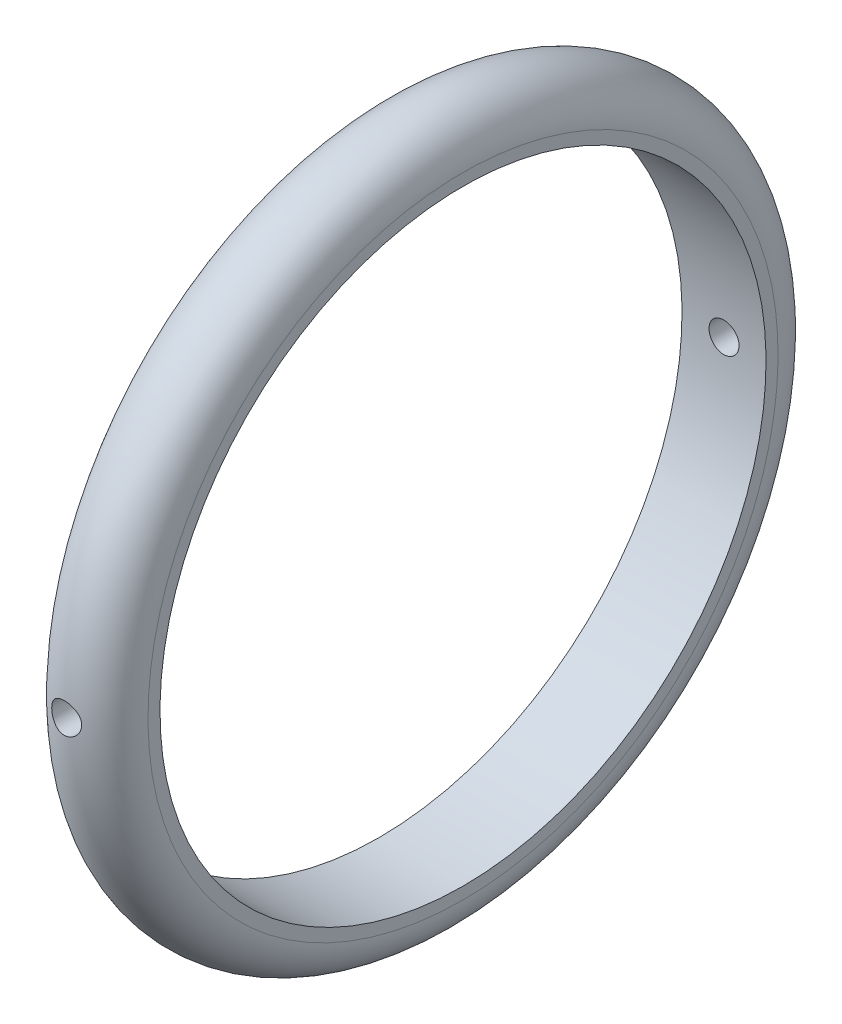
ISO-10303-21;
HEADER;
FILE_DESCRIPTION(('STEP AP214'),'2;1');
FILE_NAME('part.step','',(''),(''),'','','');
FILE_SCHEMA(('AUTOMOTIVE_DESIGN { 1 0 10303 214 1 1 1 1 }'));
ENDSEC;
DATA;
#1=APPLICATION_CONTEXT('core data for automotive mechanical design processes');
#2=APPLICATION_PROTOCOL_DEFINITION('international standard','automotive_design',2000,#1);
#3=PRODUCT_CONTEXT('',#1,'mechanical');
#4=PRODUCT('Part','Part','',(#3));
#5=PRODUCT_RELATED_PRODUCT_CATEGORY('part','',(#4));
#6=PRODUCT_DEFINITION_FORMATION('','',#4);
#7=PRODUCT_DEFINITION_CONTEXT('part definition',#1,'design');
#8=PRODUCT_DEFINITION('design','',#6,#7);
#9=PRODUCT_DEFINITION_SHAPE('','',#8);
#10=(LENGTH_UNIT() NAMED_UNIT(*) SI_UNIT(.MILLI.,.METRE.));
#11=(NAMED_UNIT(*) PLANE_ANGLE_UNIT() SI_UNIT($,.RADIAN.));
#12=(NAMED_UNIT(*) SI_UNIT($,.STERADIAN.) SOLID_ANGLE_UNIT());
#13=UNCERTAINTY_MEASURE_WITH_UNIT(LENGTH_MEASURE(1.E-05),#10,'distance_accuracy_value','');
#14=(GEOMETRIC_REPRESENTATION_CONTEXT(3) GLOBAL_UNCERTAINTY_ASSIGNED_CONTEXT((#13)) GLOBAL_UNIT_ASSIGNED_CONTEXT((#10,
#11,#12)) REPRESENTATION_CONTEXT('',''));
#15=CARTESIAN_POINT('',(0.,0.,0.));
#16=DIRECTION('',(0.,0.,1.));
#17=DIRECTION('',(1.,0.,0.));
#18=AXIS2_PLACEMENT_3D('',#15,#16,#17);
#19=CARTESIAN_POINT('',(14.,0.,0.));
#20=DIRECTION('',(1.,0.,0.));
#21=DIRECTION('',(0.,1.,0.));
#22=AXIS2_PLACEMENT_3D('',#19,#20,#21);
#23=PLANE('',#22);
#24=CARTESIAN_POINT('',(14.,0.,0.));
#25=DIRECTION('',(-1.,0.,0.));
#26=DIRECTION('',(0.,-1.,0.));
#27=AXIS2_PLACEMENT_3D('',#24,#25,#26);
#28=CIRCLE('',#27,50.5);
#29=CARTESIAN_POINT('',(14.,-50.5,0.));
#30=VERTEX_POINT('',#29);
#31=EDGE_CURVE('E95',#30,#30,#28,.T.);
#32=ORIENTED_EDGE('',*,*,#31,.T.);
#33=EDGE_LOOP('',(#32));
#34=FACE_BOUND('',#33,.T.);
#35=CARTESIAN_POINT('',(14.,0.,0.));
#36=DIRECTION('',(-1.,0.,0.));
#37=DIRECTION('',(0.,-1.,0.));
#38=AXIS2_PLACEMENT_3D('',#35,#36,#37);
#39=CIRCLE('',#38,52.5);
#40=CARTESIAN_POINT('',(14.,-52.5,0.));
#41=VERTEX_POINT('',#40);
#42=EDGE_CURVE('E10',#41,#41,#39,.T.);
#43=ORIENTED_EDGE('',*,*,#42,.F.);
#44=EDGE_LOOP('',(#43));
#45=FACE_BOUND('',#44,.T.);
#46=ADVANCED_FACE('F39',(#34,#45),#23,.T.);
#47=CARTESIAN_POINT('',(7.00000000000001,0.,0.));
#48=DIRECTION('',(-1.,0.,0.));
#49=DIRECTION('',(0.,-1.,0.));
#50=AXIS2_PLACEMENT_3D('',#47,#48,#49);
#51=TOROIDAL_SURFACE('',#50,52.5,7.);
#52=CARTESIAN_POINT('',(4.87163120326486,-1.31150534310364,-59.1540496103953));
#53=CARTESIAN_POINT('',(4.94611137543763,-1.43237184078808,-59.1751458680516));
#54=CARTESIAN_POINT('',(5.03078648713814,-1.54669430781488,-59.1979027770777));
#55=CARTESIAN_POINT('',(5.21819064564285,-1.75933464895137,-59.2441027546002));
#56=CARTESIAN_POINT('',(5.32092818611759,-1.85764495142243,-59.267546141564));
#57=CARTESIAN_POINT('',(5.54187610571056,-2.03568307051681,-59.3125295863226));
#58=CARTESIAN_POINT('',(5.6600933236139,-2.11540263036833,-59.3340687957815));
#59=CARTESIAN_POINT('',(5.90888206113082,-2.25382148004429,-59.372867145896));
#60=CARTESIAN_POINT('',(6.03944987661339,-2.31252704717126,-59.390127564238));
#61=CARTESIAN_POINT('',(6.30700379302199,-2.4061370232687,-59.4182113984056));
#62=CARTESIAN_POINT('',(6.44384235042178,-2.44143048763227,-59.4291396310481));
#63=CARTESIAN_POINT('',(6.72187707691259,-2.48847579267167,-59.4437974782728));
#64=CARTESIAN_POINT('',(6.86307213105977,-2.5002336068288,-59.4475289194326));
#65=CARTESIAN_POINT('',(7.13959141848879,-2.4997689756568,-59.4473834540307));
#66=CARTESIAN_POINT('',(7.27491852001956,-2.4885119139348,-59.4438128383451));
#67=CARTESIAN_POINT('',(7.54163533015524,-2.44436146877494,-59.4300490425526));
#68=CARTESIAN_POINT('',(7.67302510324705,-2.41146843990099,-59.4198559709726));
#69=CARTESIAN_POINT('',(7.92800008020862,-2.32527288903338,-59.393914774077));
#70=CARTESIAN_POINT('',(8.05160145523486,-2.2720143957562,-59.378178638225));
#71=CARTESIAN_POINT('',(8.28825039289515,-2.14670638438801,-59.3427014840829));
#72=CARTESIAN_POINT('',(8.40129571138131,-2.07465288289729,-59.3229596170185));
#73=CARTESIAN_POINT('',(8.61839973466392,-1.91050292582172,-59.2805667275123));
#74=CARTESIAN_POINT('',(8.72193101530284,-1.81773034740659,-59.2578318927567));
#75=CARTESIAN_POINT('',(8.91226246270208,-1.6163106785083,-59.2124908852005));
#76=CARTESIAN_POINT('',(8.99905861984361,-1.50765979462869,-59.1898847444901));
#77=CARTESIAN_POINT('',(9.15573345053969,-1.27401527772706,-59.1467084045975));
#78=CARTESIAN_POINT('',(9.22509765068741,-1.14866230928951,-59.126208816263));
#79=CARTESIAN_POINT('',(9.34160431893429,-0.887322250716197,-59.0905048490516));
#80=CARTESIAN_POINT('',(9.38875303845716,-0.751338164744109,-59.0752989808397));
#81=CARTESIAN_POINT('',(9.4580468180867,-0.476892279353115,-59.0525663488101));
#82=CARTESIAN_POINT('',(9.48090195013503,-0.338628348181984,-59.044822165996));
#83=CARTESIAN_POINT('',(9.50318003047755,-0.0600279168743091,-59.03727702302));
#84=CARTESIAN_POINT('',(9.50260985868041,0.0803079626361259,-59.0374737306533));
#85=CARTESIAN_POINT('',(9.47861282046727,0.352653580185088,-59.0455938208027));
#86=CARTESIAN_POINT('',(9.4561704227845,0.484761766958919,-59.0531843976532));
#87=CARTESIAN_POINT('',(9.39068880933288,0.743226663511598,-59.074661446413));
#88=CARTESIAN_POINT('',(9.34764719536393,0.869582701738085,-59.0885486513779));
#89=CARTESIAN_POINT('',(9.24157511219429,1.11511942205471,-59.1212435370175));
#90=CARTESIAN_POINT('',(9.17826202384154,1.23416843505485,-59.1401200859841));
#91=CARTESIAN_POINT('',(9.03362926319546,1.46026504743358,-59.1806080489575));
#92=CARTESIAN_POINT('',(8.95230476996591,1.56730942207131,-59.2022201945097));
#93=CARTESIAN_POINT('',(8.76930062284381,1.77180646448949,-59.2470075845579));
#94=CARTESIAN_POINT('',(8.66682592007329,1.86854354957395,-59.2702078397388));
#95=CARTESIAN_POINT('',(8.44682531982593,2.04363946715633,-59.3146425207346));
#96=CARTESIAN_POINT('',(8.3292982292107,2.1219968413776,-59.3358767904842));
#97=CARTESIAN_POINT('',(8.08110309217208,2.25863859255912,-59.3742615497081));
#98=CARTESIAN_POINT('',(7.95033046996602,2.3167440533655,-59.3913752457749));
#99=CARTESIAN_POINT('',(7.68019697382017,2.40992287631516,-59.4193661556015));
#100=CARTESIAN_POINT('',(7.54083872018036,2.44500322791115,-59.4302452617927));
#101=CARTESIAN_POINT('',(7.26337198190916,2.48990068483706,-59.4442497341096));
#102=CARTESIAN_POINT('',(7.12542979060554,2.50065685288313,-59.4476631416658));
#103=CARTESIAN_POINT('',(6.84968388162223,2.49928121400246,-59.4472289064025));
#104=CARTESIAN_POINT('',(6.71188014571482,2.4871529732135,-59.4433823949152));
#105=CARTESIAN_POINT('',(6.44405009168034,2.44108794125967,-59.4290358433233));
#106=CARTESIAN_POINT('',(6.31391475005143,2.40772513773251,-59.4187110185023));
#107=CARTESIAN_POINT('',(6.06113852200737,2.32086324918133,-59.3926077254359));
#108=CARTESIAN_POINT('',(5.93849849240527,2.2673618670379,-59.3768286350631));
#109=CARTESIAN_POINT('',(5.70098544393272,2.14035565746935,-59.3409395508817));
#110=CARTESIAN_POINT('',(5.58636187139479,2.06641133820982,-59.3207367089177));
#111=CARTESIAN_POINT('',(5.37084410251177,1.90113255197427,-59.2782537310103));
#112=CARTESIAN_POINT('',(5.26995378077756,1.80979319464018,-59.2559730118033));
#113=CARTESIAN_POINT('',(5.08044657780489,1.60787460263154,-59.2106716015416));
#114=CARTESIAN_POINT('',(4.99250479118163,1.49665876844976,-59.1876581467336));
#115=CARTESIAN_POINT('',(4.83644815897496,1.26058015989226,-59.1444428394473));
#116=CARTESIAN_POINT('',(4.76833341058087,1.13571731862499,-59.1242410007513));
#117=CARTESIAN_POINT('',(4.6541383069229,0.875808198045694,-59.0891500738718));
#118=CARTESIAN_POINT('',(4.60802183653252,0.740779034053491,-59.0742522881629));
#119=CARTESIAN_POINT('',(4.53936792718865,0.464282752250335,-59.0517058547109));
#120=CARTESIAN_POINT('',(4.51682146268933,0.322818120411297,-59.0440544322595));
#121=CARTESIAN_POINT('',(4.49669969002434,0.0447059905837845,-59.037232600421));
#122=CARTESIAN_POINT('',(4.49798820412494,-0.0918507946384336,-59.0376762945383));
#123=CARTESIAN_POINT('',(4.52271450297436,-0.362680252132115,-59.0460428481188));
#124=CARTESIAN_POINT('',(4.54614691938232,-0.496953469976887,-59.0539638948488));
#125=CARTESIAN_POINT('',(4.61154790061254,-0.748917441050847,-59.0753753874682));
#126=CARTESIAN_POINT('',(4.65189245480804,-0.86707736859263,-59.0883723012463));
#127=CARTESIAN_POINT('',(4.74944645382936,-1.09565444449647,-59.1185074693145));
#128=CARTESIAN_POINT('',(4.80665985241303,-1.20606977014239,-59.1356466943189));
#129=CARTESIAN_POINT('',(4.87163120326486,-1.31150534310364,-59.1540496103953));
#130=B_SPLINE_CURVE_WITH_KNOTS('',3,(#52,#53,#54,#55,#56,#57,#58,#59,#60,#61,#62,#63,#64,#65,
#66,#67,#68,#69,#70,#71,#72,#73,#74,#75,#76,#77,#78,#79,#80,#81,#82,#83,#84,#85,#86,#87,#88,#89,
#90,#91,#92,#93,#94,#95,#96,#97,#98,#99,#100,#101,#102,#103,#104,#105,#106,#107,#108,#109,#110,
#111,#112,#113,#114,#115,#116,#117,#118,#119,#120,#121,#122,#123,#124,#125,#126,#127,#128,#129),
.UNSPECIFIED.,.T.,.F.,(4,2,2,2,2,2,2,2,2,2,2,2,2,2,2,2,2,2,2,2,2,2,2,2,2,2,2,2,2,2,2,2,2,2,2,2,
2,2,4),(0.,0.430138405531225,0.86047962286309,1.29101160668486,1.72141487440096,
2.14447361590684,2.56742496908675,2.97299933709276,3.37856705882999,3.78326288380812,
4.18804454949864,4.60872627167771,5.02950866135309,5.46154351862034,5.89345672880812,
6.31236586322511,6.73115196675232,7.13191972553032,7.53273415381076,7.9393995444526,
8.34617391506368,8.77264811389196,9.19915613845166,9.62934194862443,10.059397112047,
10.4725434946889,10.8856255009576,11.2879900806276,11.6904005701768,12.10224371189,
12.5142028085994,12.9430980563828,13.3719954065142,13.8001861808131,14.228212930009,
14.6358911912682,15.043470644533,15.4186056444178,15.7938286392813),.UNSPECIFIED.);
#131=CARTESIAN_POINT('',(4.87163120326486,-1.31150534310364,-59.1540496103953));
#132=VERTEX_POINT('',#131);
#133=EDGE_CURVE('E67',#132,#132,#130,.T.);
#134=ORIENTED_EDGE('',*,*,#133,.T.);
#135=EDGE_LOOP('',(#134));
#136=FACE_BOUND('',#135,.T.);
#137=CARTESIAN_POINT('',(4.87163120326486,-1.31150534310364,59.1540496103953));
#138=CARTESIAN_POINT('',(4.94611137543763,-1.43237184078808,59.1751458680516));
#139=CARTESIAN_POINT('',(5.03078648713814,-1.54669430781488,59.1979027770777));
#140=CARTESIAN_POINT('',(5.21819064564285,-1.75933464895137,59.2441027546002));
#141=CARTESIAN_POINT('',(5.32092818611759,-1.85764495142243,59.267546141564));
#142=CARTESIAN_POINT('',(5.54187610571056,-2.03568307051681,59.3125295863226));
#143=CARTESIAN_POINT('',(5.6600933236139,-2.11540263036833,59.3340687957815));
#144=CARTESIAN_POINT('',(5.90888206113082,-2.25382148004429,59.372867145896));
#145=CARTESIAN_POINT('',(6.03944987661339,-2.31252704717126,59.390127564238));
#146=CARTESIAN_POINT('',(6.30700379302199,-2.4061370232687,59.4182113984056));
#147=CARTESIAN_POINT('',(6.44384235042178,-2.44143048763227,59.4291396310481));
#148=CARTESIAN_POINT('',(6.72187707691259,-2.48847579267167,59.4437974782728));
#149=CARTESIAN_POINT('',(6.86307213105977,-2.5002336068288,59.4475289194326));
#150=CARTESIAN_POINT('',(7.13959141848879,-2.4997689756568,59.4473834540307));
#151=CARTESIAN_POINT('',(7.27491852001956,-2.4885119139348,59.4438128383451));
#152=CARTESIAN_POINT('',(7.54163533015524,-2.44436146877494,59.4300490425526));
#153=CARTESIAN_POINT('',(7.67302510324705,-2.41146843990099,59.4198559709726));
#154=CARTESIAN_POINT('',(7.92800008020862,-2.32527288903338,59.393914774077));
#155=CARTESIAN_POINT('',(8.05160145523486,-2.2720143957562,59.378178638225));
#156=CARTESIAN_POINT('',(8.28825039289515,-2.14670638438801,59.3427014840829));
#157=CARTESIAN_POINT('',(8.40129571138131,-2.07465288289729,59.3229596170185));
#158=CARTESIAN_POINT('',(8.61839973466392,-1.91050292582172,59.2805667275123));
#159=CARTESIAN_POINT('',(8.72193101530284,-1.81773034740659,59.2578318927567));
#160=CARTESIAN_POINT('',(8.91226246270208,-1.6163106785083,59.2124908852005));
#161=CARTESIAN_POINT('',(8.99905861984361,-1.50765979462869,59.1898847444901));
#162=CARTESIAN_POINT('',(9.15573345053969,-1.27401527772706,59.1467084045975));
#163=CARTESIAN_POINT('',(9.22509765068741,-1.14866230928951,59.126208816263));
#164=CARTESIAN_POINT('',(9.34160431893429,-0.887322250716197,59.0905048490516));
#165=CARTESIAN_POINT('',(9.38875303845716,-0.751338164744109,59.0752989808397));
#166=CARTESIAN_POINT('',(9.4580468180867,-0.476892279353115,59.0525663488101));
#167=CARTESIAN_POINT('',(9.48090195013503,-0.338628348181984,59.044822165996));
#168=CARTESIAN_POINT('',(9.50318003047755,-0.0600279168743091,59.03727702302));
#169=CARTESIAN_POINT('',(9.50260985868041,0.0803079626361259,59.0374737306533));
#170=CARTESIAN_POINT('',(9.47861282046727,0.352653580185088,59.0455938208027));
#171=CARTESIAN_POINT('',(9.4561704227845,0.484761766958919,59.0531843976532));
#172=CARTESIAN_POINT('',(9.39068880933288,0.743226663511598,59.074661446413));
#173=CARTESIAN_POINT('',(9.34764719536393,0.869582701738085,59.0885486513779));
#174=CARTESIAN_POINT('',(9.24157511219429,1.11511942205471,59.1212435370175));
#175=CARTESIAN_POINT('',(9.17826202384154,1.23416843505485,59.1401200859841));
#176=CARTESIAN_POINT('',(9.03362926319546,1.46026504743358,59.1806080489575));
#177=CARTESIAN_POINT('',(8.95230476996591,1.56730942207131,59.2022201945097));
#178=CARTESIAN_POINT('',(8.76930062284381,1.77180646448949,59.2470075845579));
#179=CARTESIAN_POINT('',(8.66682592007329,1.86854354957395,59.2702078397388));
#180=CARTESIAN_POINT('',(8.44682531982593,2.04363946715633,59.3146425207346));
#181=CARTESIAN_POINT('',(8.3292982292107,2.1219968413776,59.3358767904842));
#182=CARTESIAN_POINT('',(8.08110309217208,2.25863859255912,59.3742615497081));
#183=CARTESIAN_POINT('',(7.95033046996602,2.3167440533655,59.3913752457749));
#184=CARTESIAN_POINT('',(7.68019697382017,2.40992287631516,59.4193661556015));
#185=CARTESIAN_POINT('',(7.54083872018036,2.44500322791115,59.4302452617927));
#186=CARTESIAN_POINT('',(7.26337198190916,2.48990068483706,59.4442497341096));
#187=CARTESIAN_POINT('',(7.12542979060554,2.50065685288313,59.4476631416658));
#188=CARTESIAN_POINT('',(6.84968388162223,2.49928121400246,59.4472289064025));
#189=CARTESIAN_POINT('',(6.71188014571482,2.4871529732135,59.4433823949152));
#190=CARTESIAN_POINT('',(6.44405009168034,2.44108794125967,59.4290358433233));
#191=CARTESIAN_POINT('',(6.31391475005143,2.40772513773251,59.4187110185023));
#192=CARTESIAN_POINT('',(6.06113852200737,2.32086324918133,59.3926077254359));
#193=CARTESIAN_POINT('',(5.93849849240527,2.2673618670379,59.3768286350631));
#194=CARTESIAN_POINT('',(5.70098544393272,2.14035565746935,59.3409395508817));
#195=CARTESIAN_POINT('',(5.58636187139479,2.06641133820982,59.3207367089177));
#196=CARTESIAN_POINT('',(5.37084410251177,1.90113255197427,59.2782537310103));
#197=CARTESIAN_POINT('',(5.26995378077756,1.80979319464018,59.2559730118033));
#198=CARTESIAN_POINT('',(5.08044657780489,1.60787460263154,59.2106716015416));
#199=CARTESIAN_POINT('',(4.99250479118163,1.49665876844976,59.1876581467336));
#200=CARTESIAN_POINT('',(4.83644815897496,1.26058015989226,59.1444428394473));
#201=CARTESIAN_POINT('',(4.76833341058087,1.13571731862499,59.1242410007513));
#202=CARTESIAN_POINT('',(4.6541383069229,0.875808198045694,59.0891500738718));
#203=CARTESIAN_POINT('',(4.60802183653252,0.740779034053491,59.0742522881629));
#204=CARTESIAN_POINT('',(4.53936792718865,0.464282752250335,59.0517058547109));
#205=CARTESIAN_POINT('',(4.51682146268933,0.322818120411297,59.0440544322595));
#206=CARTESIAN_POINT('',(4.49669969002434,0.0447059905837845,59.037232600421));
#207=CARTESIAN_POINT('',(4.49798820412494,-0.0918507946384336,59.0376762945383));
#208=CARTESIAN_POINT('',(4.52271450297436,-0.362680252132115,59.0460428481188));
#209=CARTESIAN_POINT('',(4.54614691938232,-0.496953469976887,59.0539638948488));
#210=CARTESIAN_POINT('',(4.61154790061254,-0.748917441050847,59.0753753874682));
#211=CARTESIAN_POINT('',(4.65189245480804,-0.86707736859263,59.0883723012463));
#212=CARTESIAN_POINT('',(4.74944645382936,-1.09565444449647,59.1185074693145));
#213=CARTESIAN_POINT('',(4.80665985241303,-1.20606977014239,59.1356466943189));
#214=CARTESIAN_POINT('',(4.87163120326486,-1.31150534310364,59.1540496103953));
#215=B_SPLINE_CURVE_WITH_KNOTS('',3,(#137,#138,#139,#140,#141,#142,#143,#144,#145,#146,#147,
#148,#149,#150,#151,#152,#153,#154,#155,#156,#157,#158,#159,#160,#161,#162,#163,#164,#165,#166,
#167,#168,#169,#170,#171,#172,#173,#174,#175,#176,#177,#178,#179,#180,#181,#182,#183,#184,#185,
#186,#187,#188,#189,#190,#191,#192,#193,#194,#195,#196,#197,#198,#199,#200,#201,#202,#203,#204,
#205,#206,#207,#208,#209,#210,#211,#212,#213,#214),.UNSPECIFIED.,.T.,.F.,(4,2,2,2,2,2,2,2,2,2,2,
2,2,2,2,2,2,2,2,2,2,2,2,2,2,2,2,2,2,2,2,2,2,2,2,2,2,2,4),(0.,0.430138405531225,0.86047962286309,
1.29101160668486,1.72141487440096,2.14447361590684,2.56742496908675,2.97299933709276,
3.37856705882999,3.78326288380812,4.18804454949864,4.60872627167771,5.02950866135309,
5.46154351862034,5.89345672880812,6.31236586322511,6.73115196675232,7.13191972553032,
7.53273415381076,7.9393995444526,8.34617391506368,8.77264811389196,9.19915613845166,
9.62934194862443,10.059397112047,10.4725434946889,10.8856255009576,11.2879900806276,
11.6904005701768,12.10224371189,12.5142028085994,12.9430980563828,13.3719954065142,
13.8001861808131,14.228212930009,14.6358911912682,15.043470644533,15.4186056444178,
15.7938286392813),.UNSPECIFIED.);
#216=CARTESIAN_POINT('',(4.87163120326486,-1.31150534310364,59.1540496103953));
#217=VERTEX_POINT('',#216);
#218=EDGE_CURVE('E91',#217,#217,#215,.T.);
#219=ORIENTED_EDGE('',*,*,#218,.F.);
#220=EDGE_LOOP('',(#219));
#221=FACE_BOUND('',#220,.T.);
#222=ORIENTED_EDGE('',*,*,#42,.T.);
#223=EDGE_LOOP('',(#222));
#224=FACE_BOUND('',#223,.T.);
#225=CARTESIAN_POINT('',(0.,0.,0.));
#226=DIRECTION('',(-1.,0.,0.));
#227=DIRECTION('',(0.,-1.,0.));
#228=AXIS2_PLACEMENT_3D('',#225,#226,#227);
#229=CIRCLE('',#228,52.5);
#230=CARTESIAN_POINT('',(0.,-52.5,0.));
#231=VERTEX_POINT('',#230);
#232=EDGE_CURVE('E52',#231,#231,#229,.T.);
#233=ORIENTED_EDGE('',*,*,#232,.F.);
#234=EDGE_LOOP('',(#233));
#235=FACE_BOUND('',#234,.T.);
#236=ADVANCED_FACE('F106',(#136,#221,#224,#235),#51,.T.);
#237=CARTESIAN_POINT('',(0.,0.,0.));
#238=DIRECTION('',(1.,0.,0.));
#239=DIRECTION('',(0.,1.,0.));
#240=AXIS2_PLACEMENT_3D('',#237,#238,#239);
#241=PLANE('',#240);
#242=CARTESIAN_POINT('',(0.,0.,0.));
#243=DIRECTION('',(-1.,0.,0.));
#244=DIRECTION('',(0.,-1.,0.));
#245=AXIS2_PLACEMENT_3D('',#242,#243,#244);
#246=CIRCLE('',#245,50.5);
#247=CARTESIAN_POINT('',(0.,-50.5,0.));
#248=VERTEX_POINT('',#247);
#249=EDGE_CURVE('E58',#248,#248,#246,.T.);
#250=ORIENTED_EDGE('',*,*,#249,.F.);
#251=EDGE_LOOP('',(#250));
#252=FACE_BOUND('',#251,.T.);
#253=ORIENTED_EDGE('',*,*,#232,.T.);
#254=EDGE_LOOP('',(#253));
#255=FACE_BOUND('',#254,.T.);
#256=ADVANCED_FACE('F103',(#252,#255),#241,.F.);
#257=CARTESIAN_POINT('',(0.,0.,0.));
#258=DIRECTION('',(-1.,0.,0.));
#259=DIRECTION('',(0.,-1.,0.));
#260=AXIS2_PLACEMENT_3D('',#257,#258,#259);
#261=CYLINDRICAL_SURFACE('',#260,50.5);
#262=CARTESIAN_POINT('',(9.50000000000001,0.,-50.5));
#263=CARTESIAN_POINT('',(9.49999380602308,-0.140333873046734,-50.4999991719207));
#264=CARTESIAN_POINT('',(9.48814415736443,-0.280767310635829,-50.4994087764744));
#265=CARTESIAN_POINT('',(9.44104153637572,-0.557760252239945,-50.4971103301742));
#266=CARTESIAN_POINT('',(9.40576097781372,-0.694314991846838,-50.4954009619389));
#267=CARTESIAN_POINT('',(9.31280901956843,-0.959497933998789,-50.4910580452382));
#268=CARTESIAN_POINT('',(9.25514901688224,-1.08813013261895,-50.4884249672486));
#269=CARTESIAN_POINT('',(9.11909240274234,-1.33385500406727,-50.4825311933611));
#270=CARTESIAN_POINT('',(9.04070069154387,-1.45095039483054,-50.4792706458249));
#271=CARTESIAN_POINT('',(8.86531916978808,-1.67042892460845,-50.4724851149893));
#272=CARTESIAN_POINT('',(8.76831326769644,-1.7727991991502,-50.4689599045119));
#273=CARTESIAN_POINT('',(8.55848907166786,-1.95981197734057,-50.4620443203098));
#274=CARTESIAN_POINT('',(8.44567013261879,-2.04445375738207,-50.4586539520934));
#275=CARTESIAN_POINT('',(8.20735517917187,-2.19364212397299,-50.4523887703124));
#276=CARTESIAN_POINT('',(8.08185288965359,-2.25817869831901,-50.4495142139185));
#277=CARTESIAN_POINT('',(7.8217779630117,-2.36526045200892,-50.4446075694941));
#278=CARTESIAN_POINT('',(7.68720539372585,-2.40780579580736,-50.4425754751634));
#279=CARTESIAN_POINT('',(7.41292796780391,-2.46966348655875,-50.4395849566154));
#280=CARTESIAN_POINT('',(7.27322745096724,-2.48899503263423,-50.4386256451912));
#281=CARTESIAN_POINT('',(6.99256116998493,-2.50393561068299,-50.4378862077855));
#282=CARTESIAN_POINT('',(6.85159541568049,-2.49954482701221,-50.4381060726401));
#283=CARTESIAN_POINT('',(6.57253065065294,-2.46718138120423,-50.4396993693056));
#284=CARTESIAN_POINT('',(6.43442922766302,-2.43922946277688,-50.4410717863818));
#285=CARTESIAN_POINT('',(6.16488115255658,-2.36056934436505,-50.4448139035345));
#286=CARTESIAN_POINT('',(6.03343452814999,-2.30986104963389,-50.4471836077632));
#287=CARTESIAN_POINT('',(5.78086050970624,-2.18710390713859,-50.4526543810142));
#288=CARTESIAN_POINT('',(5.6597377202031,-2.11504560052617,-50.4557557740775));
#289=CARTESIAN_POINT('',(5.43129996900045,-1.95164079928016,-50.4623400350711));
#290=CARTESIAN_POINT('',(5.32398510272809,-1.86029417135568,-50.4658229056375));
#291=CARTESIAN_POINT('',(5.12608873498991,-1.66078865424342,-50.4727820762788));
#292=CARTESIAN_POINT('',(5.03552534222642,-1.55261180104226,-50.4762583652686));
#293=CARTESIAN_POINT('',(4.87384222126613,-1.32257971769054,-50.4828089528294));
#294=CARTESIAN_POINT('',(4.80272249779139,-1.2007244842181,-50.4858832513029));
#295=CARTESIAN_POINT('',(4.68194728848463,-0.946784086436926,-50.4912835089993));
#296=CARTESIAN_POINT('',(4.63229243263773,-0.814698622009231,-50.4936094462578));
#297=CARTESIAN_POINT('',(4.55586830594898,-0.544051878386733,-50.4972505217618));
#298=CARTESIAN_POINT('',(4.52909886713978,-0.405490646728641,-50.4985656674261));
#299=CARTESIAN_POINT('',(4.49922777578027,-0.12598282625877,-50.5000359861585));
#300=CARTESIAN_POINT('',(4.49610107532711,0.0149610795072138,-50.5001923868359));
#301=CARTESIAN_POINT('',(4.51353885238148,0.295371562798033,-50.4993308479359));
#302=CARTESIAN_POINT('',(4.53410325310578,0.434838145109418,-50.4983129121645));
#303=CARTESIAN_POINT('',(4.59831875303397,0.70826485912406,-50.4952181455988));
#304=CARTESIAN_POINT('',(4.64195841735453,0.842227682795677,-50.4931418392953));
#305=CARTESIAN_POINT('',(4.7510740812483,1.10092708228954,-50.4881641017727));
#306=CARTESIAN_POINT('',(4.81655020402051,1.22566360605313,-50.4852626658982));
#307=CARTESIAN_POINT('',(4.96754429806844,1.46248461281477,-50.4789580224198));
#308=CARTESIAN_POINT('',(5.05307906193019,1.57455837774006,-50.4755543952844));
#309=CARTESIAN_POINT('',(5.24173788164618,1.78276474022073,-50.4686300904742));
#310=CARTESIAN_POINT('',(5.34486204824137,1.87889723740414,-50.4651094120626));
#311=CARTESIAN_POINT('',(5.56588009737582,2.05257652234501,-50.4583443245312));
#312=CARTESIAN_POINT('',(5.68378672227481,2.13010710535206,-50.4551001578645));
#313=CARTESIAN_POINT('',(5.93095834956437,2.26427099941843,-50.4492577316497));
#314=CARTESIAN_POINT('',(6.06022330324749,2.32090440008487,-50.446659469332));
#315=CARTESIAN_POINT('',(6.32638216547152,2.41163805516086,-50.4424035746678));
#316=CARTESIAN_POINT('',(6.4632725435552,2.44574864480204,-50.4407455109339));
#317=CARTESIAN_POINT('',(6.74084586141232,2.49050220849662,-50.4385557730516));
#318=CARTESIAN_POINT('',(6.88152878021178,2.50114531230591,-50.4380240926752));
#319=CARTESIAN_POINT('',(7.16253238561991,2.49866054752466,-50.4381472331909));
#320=CARTESIAN_POINT('',(7.30285329893118,2.48555817284914,-50.4388007815835));
#321=CARTESIAN_POINT('',(7.57930062474404,2.43600707155681,-50.4412180307248));
#322=CARTESIAN_POINT('',(7.71542702923912,2.39955830037912,-50.4429817335923));
#323=CARTESIAN_POINT('',(7.97962661966899,2.30435423360032,-50.4474202225523));
#324=CARTESIAN_POINT('',(8.10769974325727,2.24559876533107,-50.4500950156971));
#325=CARTESIAN_POINT('',(8.35216509366041,2.10745361020037,-50.4560541281983));
#326=CARTESIAN_POINT('',(8.46855768068401,2.02806455991622,-50.4593384287496));
#327=CARTESIAN_POINT('',(8.68648521562257,1.85081470381759,-50.4661504014861));
#328=CARTESIAN_POINT('',(8.78800573274211,1.75293616516684,-50.4696783052274));
#329=CARTESIAN_POINT('',(8.97320580597549,1.54149667838514,-50.4765782485841));
#330=CARTESIAN_POINT('',(9.05688096600681,1.4279318773762,-50.4799502496342));
#331=CARTESIAN_POINT('',(9.20405344437576,1.18825580405818,-50.4861607085009));
#332=CARTESIAN_POINT('',(9.26753154868726,1.06213273355065,-50.4889986572165));
#333=CARTESIAN_POINT('',(9.3723354431115,0.80109950549716,-50.4938135723621));
#334=CARTESIAN_POINT('',(9.41368740624146,0.666199942570722,-50.4957915555238));
#335=CARTESIAN_POINT('',(9.46221502787823,0.442051509181116,-50.4981403200821));
#336=CARTESIAN_POINT('',(9.47636631051769,0.354254583592481,-50.4988346364298));
#337=CARTESIAN_POINT('',(9.49526075336218,0.177651740582632,-50.499764738327));
#338=CARTESIAN_POINT('',(9.50000392142662,0.0888458240043764,-50.5000005242596));
#339=CARTESIAN_POINT('',(9.50000000000001,0.,-50.5));
#340=B_SPLINE_CURVE_WITH_KNOTS('',3,(#262,#263,#264,#265,#266,#267,#268,#269,#270,#271,#272,
#273,#274,#275,#276,#277,#278,#279,#280,#281,#282,#283,#284,#285,#286,#287,#288,#289,#290,#291,
#292,#293,#294,#295,#296,#297,#298,#299,#300,#301,#302,#303,#304,#305,#306,#307,#308,#309,#310,
#311,#312,#313,#314,#315,#316,#317,#318,#319,#320,#321,#322,#323,#324,#325,#326,#327,#328,#329,
#330,#331,#332,#333,#334,#335,#336,#337,#338,#339),.UNSPECIFIED.,.T.,.F.,(4,2,2,2,2,2,2,2,2,2,2,
2,2,2,2,2,2,2,2,2,2,2,2,2,2,2,2,2,2,2,2,2,2,2,2,2,2,2,4),(0.,0.42067729940362,0.841850760635201,
1.26281001512596,1.68366985827314,2.10489517750985,2.52613768615132,2.94758963550489,
3.369038433116,3.79013842815604,4.21123515066042,4.63196151768025,5.05268963641977,
5.4736044327752,5.89452213793423,6.31589223830256,6.73726244100393,7.15864500990959,
7.58002448605482,8.00095747614633,8.42188910199111,8.84261233154503,9.2633379348155,
9.6844170242836,10.1054987649171,10.5269460028423,10.9483914335807,11.369643337461,
11.7908929121587,12.2116904875641,12.6324888661413,13.0532905020344,13.4740791570998,
13.8952734487502,14.3165713792098,14.7382689120974,15.1594665098809,15.4257988765214,
15.6921310206717),.UNSPECIFIED.);
#341=CARTESIAN_POINT('',(9.50000000000001,0.,-50.5));
#342=VERTEX_POINT('',#341);
#343=EDGE_CURVE('E42',#342,#342,#340,.T.);
#344=ORIENTED_EDGE('',*,*,#343,.T.);
#345=EDGE_LOOP('',(#344));
#346=FACE_BOUND('',#345,.T.);
#347=CARTESIAN_POINT('',(9.50000000000001,0.,50.5));
#348=CARTESIAN_POINT('',(9.49999380602308,0.140333873046733,50.4999991719207));
#349=CARTESIAN_POINT('',(9.48814415736443,0.280767310635829,50.4994087764744));
#350=CARTESIAN_POINT('',(9.44104153637572,0.557760252239945,50.4971103301742));
#351=CARTESIAN_POINT('',(9.40576097781372,0.694314991846838,50.4954009619389));
#352=CARTESIAN_POINT('',(9.31280901956843,0.959497933998789,50.4910580452382));
#353=CARTESIAN_POINT('',(9.25514901688224,1.08813013261895,50.4884249672486));
#354=CARTESIAN_POINT('',(9.11909240274234,1.33385500406727,50.4825311933611));
#355=CARTESIAN_POINT('',(9.04070069154387,1.45095039483054,50.4792706458249));
#356=CARTESIAN_POINT('',(8.86531916978808,1.67042892460845,50.4724851149893));
#357=CARTESIAN_POINT('',(8.76831326769644,1.7727991991502,50.4689599045119));
#358=CARTESIAN_POINT('',(8.55848907166786,1.95981197734057,50.4620443203098));
#359=CARTESIAN_POINT('',(8.44567013261879,2.04445375738207,50.4586539520934));
#360=CARTESIAN_POINT('',(8.20735517917187,2.19364212397299,50.4523887703124));
#361=CARTESIAN_POINT('',(8.08185288965359,2.25817869831901,50.4495142139185));
#362=CARTESIAN_POINT('',(7.8217779630117,2.36526045200892,50.4446075694941));
#363=CARTESIAN_POINT('',(7.68720539372585,2.40780579580736,50.4425754751634));
#364=CARTESIAN_POINT('',(7.41292796780391,2.46966348655875,50.4395849566154));
#365=CARTESIAN_POINT('',(7.27322745096724,2.48899503263423,50.4386256451912));
#366=CARTESIAN_POINT('',(6.99256116998493,2.50393561068299,50.4378862077855));
#367=CARTESIAN_POINT('',(6.85159541568049,2.49954482701221,50.4381060726401));
#368=CARTESIAN_POINT('',(6.57253065065294,2.46718138120423,50.4396993693056));
#369=CARTESIAN_POINT('',(6.43442922766302,2.43922946277688,50.4410717863818));
#370=CARTESIAN_POINT('',(6.16488115255658,2.36056934436505,50.4448139035345));
#371=CARTESIAN_POINT('',(6.03343452814999,2.30986104963389,50.4471836077632));
#372=CARTESIAN_POINT('',(5.78086050970624,2.18710390713859,50.4526543810142));
#373=CARTESIAN_POINT('',(5.6597377202031,2.11504560052617,50.4557557740775));
#374=CARTESIAN_POINT('',(5.43129996900045,1.95164079928016,50.4623400350711));
#375=CARTESIAN_POINT('',(5.32398510272809,1.86029417135568,50.4658229056375));
#376=CARTESIAN_POINT('',(5.12608873498991,1.66078865424342,50.4727820762788));
#377=CARTESIAN_POINT('',(5.03552534222642,1.55261180104226,50.4762583652686));
#378=CARTESIAN_POINT('',(4.87384222126613,1.32257971769054,50.4828089528294));
#379=CARTESIAN_POINT('',(4.80272249779139,1.2007244842181,50.4858832513029));
#380=CARTESIAN_POINT('',(4.68194728848463,0.946784086436926,50.4912835089993));
#381=CARTESIAN_POINT('',(4.63229243263773,0.814698622009231,50.4936094462578));
#382=CARTESIAN_POINT('',(4.55586830594898,0.544051878386733,50.4972505217618));
#383=CARTESIAN_POINT('',(4.52909886713978,0.405490646728641,50.4985656674261));
#384=CARTESIAN_POINT('',(4.49922777578027,0.12598282625877,50.5000359861585));
#385=CARTESIAN_POINT('',(4.49610107532711,-0.0149610795072138,50.5001923868359));
#386=CARTESIAN_POINT('',(4.51353885238148,-0.295371562798033,50.4993308479359));
#387=CARTESIAN_POINT('',(4.53410325310578,-0.434838145109418,50.4983129121645));
#388=CARTESIAN_POINT('',(4.59831875303397,-0.70826485912406,50.4952181455988));
#389=CARTESIAN_POINT('',(4.64195841735453,-0.842227682795677,50.4931418392953));
#390=CARTESIAN_POINT('',(4.7510740812483,-1.10092708228954,50.4881641017727));
#391=CARTESIAN_POINT('',(4.81655020402051,-1.22566360605313,50.4852626658982));
#392=CARTESIAN_POINT('',(4.96754429806844,-1.46248461281477,50.4789580224198));
#393=CARTESIAN_POINT('',(5.05307906193019,-1.57455837774006,50.4755543952844));
#394=CARTESIAN_POINT('',(5.24173788164618,-1.78276474022073,50.4686300904742));
#395=CARTESIAN_POINT('',(5.34486204824137,-1.87889723740414,50.4651094120626));
#396=CARTESIAN_POINT('',(5.56588009737582,-2.05257652234501,50.4583443245312));
#397=CARTESIAN_POINT('',(5.68378672227481,-2.13010710535206,50.4551001578645));
#398=CARTESIAN_POINT('',(5.93095834956437,-2.26427099941843,50.4492577316497));
#399=CARTESIAN_POINT('',(6.06022330324749,-2.32090440008487,50.446659469332));
#400=CARTESIAN_POINT('',(6.32638216547152,-2.41163805516086,50.4424035746678));
#401=CARTESIAN_POINT('',(6.4632725435552,-2.44574864480204,50.4407455109339));
#402=CARTESIAN_POINT('',(6.74084586141232,-2.49050220849662,50.4385557730516));
#403=CARTESIAN_POINT('',(6.88152878021178,-2.50114531230591,50.4380240926752));
#404=CARTESIAN_POINT('',(7.16253238561991,-2.49866054752466,50.4381472331909));
#405=CARTESIAN_POINT('',(7.30285329893118,-2.48555817284914,50.4388007815835));
#406=CARTESIAN_POINT('',(7.57930062474404,-2.43600707155681,50.4412180307248));
#407=CARTESIAN_POINT('',(7.71542702923912,-2.39955830037912,50.4429817335923));
#408=CARTESIAN_POINT('',(7.97962661966899,-2.30435423360032,50.4474202225523));
#409=CARTESIAN_POINT('',(8.10769974325727,-2.24559876533107,50.4500950156971));
#410=CARTESIAN_POINT('',(8.35216509366041,-2.10745361020037,50.4560541281983));
#411=CARTESIAN_POINT('',(8.46855768068401,-2.02806455991622,50.4593384287496));
#412=CARTESIAN_POINT('',(8.68648521562257,-1.85081470381759,50.4661504014861));
#413=CARTESIAN_POINT('',(8.78800573274211,-1.75293616516684,50.4696783052274));
#414=CARTESIAN_POINT('',(8.97320580597549,-1.54149667838514,50.4765782485841));
#415=CARTESIAN_POINT('',(9.05688096600681,-1.4279318773762,50.4799502496342));
#416=CARTESIAN_POINT('',(9.20405344437576,-1.18825580405818,50.4861607085009));
#417=CARTESIAN_POINT('',(9.26753154868726,-1.06213273355065,50.4889986572165));
#418=CARTESIAN_POINT('',(9.3723354431115,-0.80109950549716,50.4938135723621));
#419=CARTESIAN_POINT('',(9.41368740624146,-0.666199942570722,50.4957915555238));
#420=CARTESIAN_POINT('',(9.46221502787823,-0.442051509181116,50.4981403200821));
#421=CARTESIAN_POINT('',(9.47636631051769,-0.354254583592481,50.4988346364298));
#422=CARTESIAN_POINT('',(9.49526075336218,-0.177651740582632,50.499764738327));
#423=CARTESIAN_POINT('',(9.50000392142662,-0.0888458240043763,50.5000005242596));
#424=CARTESIAN_POINT('',(9.50000000000001,0.,50.5));
#425=B_SPLINE_CURVE_WITH_KNOTS('',3,(#347,#348,#349,#350,#351,#352,#353,#354,#355,#356,#357,
#358,#359,#360,#361,#362,#363,#364,#365,#366,#367,#368,#369,#370,#371,#372,#373,#374,#375,#376,
#377,#378,#379,#380,#381,#382,#383,#384,#385,#386,#387,#388,#389,#390,#391,#392,#393,#394,#395,
#396,#397,#398,#399,#400,#401,#402,#403,#404,#405,#406,#407,#408,#409,#410,#411,#412,#413,#414,
#415,#416,#417,#418,#419,#420,#421,#422,#423,#424),.UNSPECIFIED.,.T.,.F.,(4,2,2,2,2,2,2,2,2,2,2,
2,2,2,2,2,2,2,2,2,2,2,2,2,2,2,2,2,2,2,2,2,2,2,2,2,2,2,4),(0.,0.42067729940362,0.841850760635201,
1.26281001512596,1.68366985827314,2.10489517750985,2.52613768615132,2.94758963550489,
3.369038433116,3.79013842815604,4.21123515066042,4.63196151768025,5.05268963641977,
5.4736044327752,5.89452213793423,6.31589223830256,6.73726244100393,7.15864500990959,
7.58002448605482,8.00095747614633,8.42188910199111,8.84261233154503,9.2633379348155,
9.6844170242836,10.1054987649171,10.5269460028423,10.9483914335807,11.369643337461,
11.7908929121587,12.2116904875641,12.6324888661413,13.0532905020344,13.4740791570998,
13.8952734487502,14.3165713792098,14.7382689120974,15.1594665098809,15.4257988765214,
15.6921310206717),.UNSPECIFIED.);
#426=CARTESIAN_POINT('',(9.50000000000001,0.,50.5));
#427=VERTEX_POINT('',#426);
#428=EDGE_CURVE('E61',#427,#427,#425,.T.);
#429=ORIENTED_EDGE('',*,*,#428,.T.);
#430=EDGE_LOOP('',(#429));
#431=FACE_BOUND('',#430,.T.);
#432=ORIENTED_EDGE('',*,*,#31,.F.);
#433=EDGE_LOOP('',(#432));
#434=FACE_BOUND('',#433,.T.);
#435=ORIENTED_EDGE('',*,*,#249,.T.);
#436=EDGE_LOOP('',(#435));
#437=FACE_BOUND('',#436,.T.);
#438=ADVANCED_FACE('F68',(#346,#431,#434,#437),#261,.F.);
#439=CARTESIAN_POINT('',(7.00000000000001,0.,-59.501));
#440=DIRECTION('',(0.,0.,1.));
#441=DIRECTION('',(1.,0.,0.));
#442=AXIS2_PLACEMENT_3D('',#439,#440,#441);
#443=CYLINDRICAL_SURFACE('',#442,2.5);
#444=ORIENTED_EDGE('',*,*,#218,.T.);
#445=EDGE_LOOP('',(#444));
#446=FACE_BOUND('',#445,.T.);
#447=ORIENTED_EDGE('',*,*,#428,.F.);
#448=EDGE_LOOP('',(#447));
#449=FACE_BOUND('',#448,.T.);
#450=ADVANCED_FACE('F76',(#446,#449),#443,.F.);
#451=ORIENTED_EDGE('',*,*,#133,.F.);
#452=EDGE_LOOP('',(#451));
#453=FACE_BOUND('',#452,.T.);
#454=ORIENTED_EDGE('',*,*,#343,.F.);
#455=EDGE_LOOP('',(#454));
#456=FACE_BOUND('',#455,.T.);
#457=ADVANCED_FACE('F72',(#453,#456),#443,.F.);
#458=CLOSED_SHELL('',(#46,#236,#256,#438,#450,#457));
#459=MANIFOLD_SOLID_BREP('B2',#458);
#460=ADVANCED_BREP_SHAPE_REPRESENTATION('',(#18,#459),#14);
#461=SHAPE_DEFINITION_REPRESENTATION(#9,#460);
ENDSEC;
END-ISO-10303-21;
